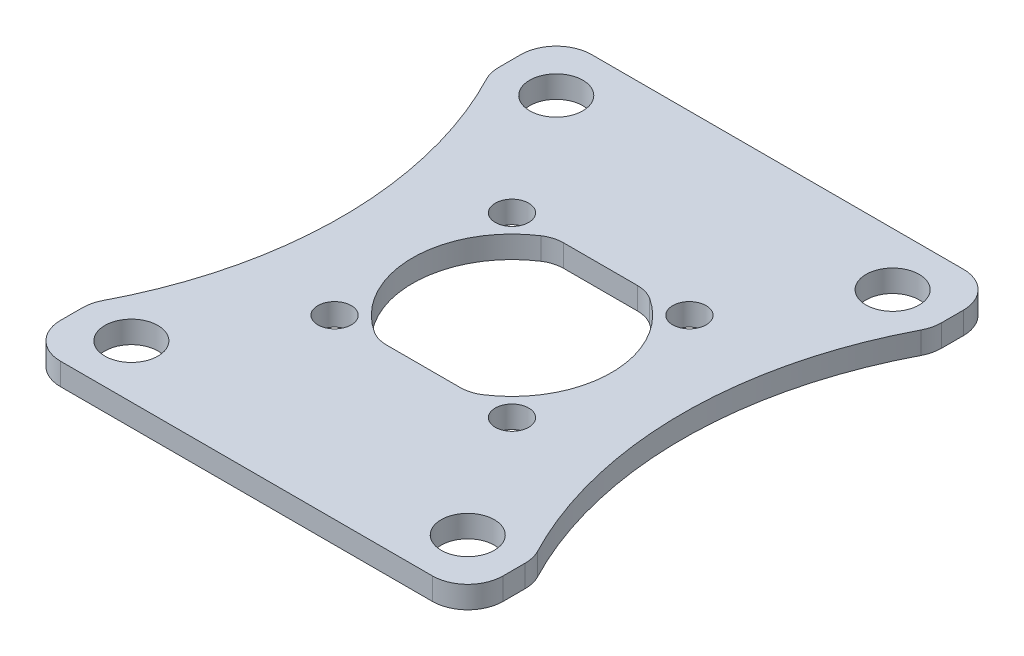
ISO-10303-21;
HEADER;
FILE_DESCRIPTION(('STEP AP214'),'2;1');
FILE_NAME('part.step','',(''),(''),'','','');
FILE_SCHEMA(('AUTOMOTIVE_DESIGN { 1 0 10303 214 1 1 1 1 }'));
ENDSEC;
DATA;
#1=APPLICATION_CONTEXT('core data for automotive mechanical design processes');
#2=APPLICATION_PROTOCOL_DEFINITION('international standard','automotive_design',2000,#1);
#3=PRODUCT_CONTEXT('',#1,'mechanical');
#4=PRODUCT('Part','Part','',(#3));
#5=PRODUCT_RELATED_PRODUCT_CATEGORY('part','',(#4));
#6=PRODUCT_DEFINITION_FORMATION('','',#4);
#7=PRODUCT_DEFINITION_CONTEXT('part definition',#1,'design');
#8=PRODUCT_DEFINITION('design','',#6,#7);
#9=PRODUCT_DEFINITION_SHAPE('','',#8);
#10=(LENGTH_UNIT() NAMED_UNIT(*) SI_UNIT(.MILLI.,.METRE.));
#11=(NAMED_UNIT(*) PLANE_ANGLE_UNIT() SI_UNIT($,.RADIAN.));
#12=(NAMED_UNIT(*) SI_UNIT($,.STERADIAN.) SOLID_ANGLE_UNIT());
#13=UNCERTAINTY_MEASURE_WITH_UNIT(LENGTH_MEASURE(1.E-05),#10,'distance_accuracy_value','');
#14=(GEOMETRIC_REPRESENTATION_CONTEXT(3) GLOBAL_UNCERTAINTY_ASSIGNED_CONTEXT((#13)) GLOBAL_UNIT_ASSIGNED_CONTEXT((#10,
#11,#12)) REPRESENTATION_CONTEXT('',''));
#15=CARTESIAN_POINT('',(0.,0.,0.));
#16=DIRECTION('',(0.,0.,1.));
#17=DIRECTION('',(1.,0.,0.));
#18=AXIS2_PLACEMENT_3D('',#15,#16,#17);
#19=CARTESIAN_POINT('',(15.875,1.5875,19.05));
#20=DIRECTION('',(-1.,0.,0.));
#21=DIRECTION('',(0.,0.,1.));
#22=AXIS2_PLACEMENT_3D('',#19,#20,#21);
#23=PLANE('',#22);
#24=DIRECTION('',(0.,0.,-1.));
#25=VECTOR('',#24,1.);
#26=CARTESIAN_POINT('',(15.875,0.,19.05));
#27=LINE('',#26,#25);
#28=CARTESIAN_POINT('',(15.875,0.,-14.9320894720063));
#29=VERTEX_POINT('',#28);
#30=CARTESIAN_POINT('',(15.875,0.,-16.51));
#31=VERTEX_POINT('',#30);
#32=EDGE_CURVE('E319',#29,#31,#27,.T.);
#33=ORIENTED_EDGE('',*,*,#32,.T.);
#34=DIRECTION('',(0.,-1.,0.));
#35=VECTOR('',#34,1.);
#36=CARTESIAN_POINT('',(15.875,1.5875,-16.51));
#37=LINE('',#36,#35);
#38=CARTESIAN_POINT('',(15.875,1.5875,-16.51));
#39=VERTEX_POINT('',#38);
#40=EDGE_CURVE('E368',#31,#39,#37,.F.);
#41=ORIENTED_EDGE('',*,*,#40,.T.);
#42=DIRECTION('',(0.,0.,-1.));
#43=VECTOR('',#42,1.);
#44=CARTESIAN_POINT('',(15.875,1.5875,19.05));
#45=LINE('',#44,#43);
#46=CARTESIAN_POINT('',(15.875,1.5875,-14.9320894720063));
#47=VERTEX_POINT('',#46);
#48=EDGE_CURVE('E300',#47,#39,#45,.T.);
#49=ORIENTED_EDGE('',*,*,#48,.F.);
#50=DIRECTION('',(0.,-1.,0.));
#51=VECTOR('',#50,1.);
#52=CARTESIAN_POINT('',(15.875,1.5875,-14.9320894720063));
#53=LINE('',#52,#51);
#54=EDGE_CURVE('E365',#47,#29,#53,.T.);
#55=ORIENTED_EDGE('',*,*,#54,.T.);
#56=EDGE_LOOP('',(#33,#41,#49,#55));
#57=FACE_BOUND('',#56,.T.);
#58=ADVANCED_FACE('F35',(#57),#23,.F.);
#59=CARTESIAN_POINT('',(-15.875,1.5875,19.05));
#60=DIRECTION('',(1.,0.,0.));
#61=DIRECTION('',(0.,0.,-1.));
#62=AXIS2_PLACEMENT_3D('',#59,#60,#61);
#63=PLANE('',#62);
#64=DIRECTION('',(0.,0.,1.));
#65=VECTOR('',#64,1.);
#66=CARTESIAN_POINT('',(-15.875,0.,19.05));
#67=LINE('',#66,#65);
#68=CARTESIAN_POINT('',(-15.875,0.,14.9320894720063));
#69=VERTEX_POINT('',#68);
#70=CARTESIAN_POINT('',(-15.875,0.,16.51));
#71=VERTEX_POINT('',#70);
#72=EDGE_CURVE('E322',#69,#71,#67,.T.);
#73=ORIENTED_EDGE('',*,*,#72,.T.);
#74=DIRECTION('',(0.,-1.,0.));
#75=VECTOR('',#74,1.);
#76=CARTESIAN_POINT('',(-15.875,1.5875,16.51));
#77=LINE('',#76,#75);
#78=CARTESIAN_POINT('',(-15.875,1.5875,16.51));
#79=VERTEX_POINT('',#78);
#80=EDGE_CURVE('E388',#71,#79,#77,.F.);
#81=ORIENTED_EDGE('',*,*,#80,.T.);
#82=DIRECTION('',(0.,0.,1.));
#83=VECTOR('',#82,1.);
#84=CARTESIAN_POINT('',(-15.875,1.5875,19.05));
#85=LINE('',#84,#83);
#86=CARTESIAN_POINT('',(-15.875,1.5875,14.9320894720063));
#87=VERTEX_POINT('',#86);
#88=EDGE_CURVE('E308',#87,#79,#85,.T.);
#89=ORIENTED_EDGE('',*,*,#88,.F.);
#90=DIRECTION('',(0.,-1.,0.));
#91=VECTOR('',#90,1.);
#92=CARTESIAN_POINT('',(-15.875,1.5875,14.9320894720063));
#93=LINE('',#92,#91);
#94=EDGE_CURVE('E385',#87,#69,#93,.T.);
#95=ORIENTED_EDGE('',*,*,#94,.T.);
#96=EDGE_LOOP('',(#73,#81,#89,#95));
#97=FACE_BOUND('',#96,.T.);
#98=ADVANCED_FACE('F481',(#97),#63,.F.);
#99=CARTESIAN_POINT('',(0.,1.5875,0.));
#100=DIRECTION('',(0.,-1.,0.));
#101=DIRECTION('',(0.,0.,-1.));
#102=AXIS2_PLACEMENT_3D('',#99,#100,#101);
#103=CYLINDRICAL_SURFACE('',#102,7.1374);
#104=CARTESIAN_POINT('',(0.,1.5875,0.));
#105=DIRECTION('',(0.,1.,0.));
#106=DIRECTION('',(0.,0.,1.));
#107=AXIS2_PLACEMENT_3D('',#104,#105,#106);
#108=CIRCLE('',#107,7.1374);
#109=CARTESIAN_POINT('',(3.89799317546401,1.5875,5.97897382198952));
#110=VERTEX_POINT('',#109);
#111=CARTESIAN_POINT('',(3.89799317546401,1.5875,-5.97897382198953));
#112=VERTEX_POINT('',#111);
#113=EDGE_CURVE('E293',#110,#112,#108,.T.);
#114=ORIENTED_EDGE('',*,*,#113,.T.);
#115=DIRECTION('',(0.,-1.,0.));
#116=VECTOR('',#115,1.);
#117=CARTESIAN_POINT('',(3.89799317546401,1.5875,-5.97897382198953));
#118=LINE('',#117,#116);
#119=CARTESIAN_POINT('',(3.89799317546401,0.,-5.97897382198953));
#120=VERTEX_POINT('',#119);
#121=EDGE_CURVE('E403',#112,#120,#118,.T.);
#122=ORIENTED_EDGE('',*,*,#121,.T.);
#123=CARTESIAN_POINT('',(0.,0.,0.));
#124=DIRECTION('',(0.,1.,0.));
#125=DIRECTION('',(0.,0.,1.));
#126=AXIS2_PLACEMENT_3D('',#123,#124,#125);
#127=CIRCLE('',#126,7.1374);
#128=CARTESIAN_POINT('',(3.89799317546401,0.,5.97897382198952));
#129=VERTEX_POINT('',#128);
#130=EDGE_CURVE('E290',#129,#120,#127,.T.);
#131=ORIENTED_EDGE('',*,*,#130,.F.);
#132=DIRECTION('',(0.,-1.,0.));
#133=VECTOR('',#132,1.);
#134=CARTESIAN_POINT('',(3.89799317546401,1.5875,5.97897382198952));
#135=LINE('',#134,#133);
#136=EDGE_CURVE('E400',#129,#110,#135,.F.);
#137=ORIENTED_EDGE('',*,*,#136,.T.);
#138=EDGE_LOOP('',(#114,#122,#131,#137));
#139=FACE_BOUND('',#138,.T.);
#140=ADVANCED_FACE('F434',(#139),#103,.F.);
#141=CARTESIAN_POINT('',(0.,1.5875,0.));
#142=DIRECTION('',(0.,-1.,0.));
#143=DIRECTION('',(0.,0.,-1.));
#144=AXIS2_PLACEMENT_3D('',#141,#142,#143);
#145=PLANE('',#144);
#146=CARTESIAN_POINT('',(-15.875,1.5875,-16.51));
#147=VERTEX_POINT('',#146);
#148=CARTESIAN_POINT('',(-15.875,1.5875,-14.9320894720063));
#149=VERTEX_POINT('',#148);
#150=EDGE_CURVE('E311',#147,#149,#85,.T.);
#151=ORIENTED_EDGE('',*,*,#150,.T.);
#152=CARTESIAN_POINT('',(-13.335,1.5875,-14.9320894720063));
#153=DIRECTION('',(0.,-1.,0.));
#154=DIRECTION('',(0.,0.,-1.));
#155=AXIS2_PLACEMENT_3D('',#152,#153,#154);
#156=CIRCLE('',#155,2.54);
#157=CARTESIAN_POINT('',(-15.5874528301887,1.5875,-13.7581830669743));
#158=VERTEX_POINT('',#157);
#159=EDGE_CURVE('E358',#149,#158,#156,.F.);
#160=ORIENTED_EDGE('',*,*,#159,.T.);
#161=CARTESIAN_POINT('',(-41.9862,1.5875,0.));
#162=DIRECTION('',(0.,-1.,0.));
#163=DIRECTION('',(0.,0.,1.));
#164=AXIS2_PLACEMENT_3D('',#161,#162,#163);
#165=CIRCLE('',#164,29.7688);
#166=CARTESIAN_POINT('',(-15.5874528301887,1.5875,13.7581830669743));
#167=VERTEX_POINT('',#166);
#168=EDGE_CURVE('E217',#158,#167,#165,.T.);
#169=ORIENTED_EDGE('',*,*,#168,.T.);
#170=CARTESIAN_POINT('',(-13.335,1.5875,14.9320894720063));
#171=DIRECTION('',(0.,-1.,0.));
#172=DIRECTION('',(0.,0.,-1.));
#173=AXIS2_PLACEMENT_3D('',#170,#171,#172);
#174=CIRCLE('',#173,2.54);
#175=EDGE_CURVE('E344',#167,#87,#174,.F.);
#176=ORIENTED_EDGE('',*,*,#175,.T.);
#177=ORIENTED_EDGE('',*,*,#88,.T.);
#178=CARTESIAN_POINT('',(-13.335,1.5875,16.51));
#179=DIRECTION('',(0.,-1.,0.));
#180=DIRECTION('',(0.,0.,-1.));
#181=AXIS2_PLACEMENT_3D('',#178,#179,#180);
#182=CIRCLE('',#181,2.54);
#183=CARTESIAN_POINT('',(-13.335,1.5875,19.05));
#184=VERTEX_POINT('',#183);
#185=EDGE_CURVE('E346',#79,#184,#182,.F.);
#186=ORIENTED_EDGE('',*,*,#185,.T.);
#187=DIRECTION('',(1.,0.,0.));
#188=VECTOR('',#187,1.);
#189=CARTESIAN_POINT('',(-15.875,1.5875,19.05));
#190=LINE('',#189,#188);
#191=CARTESIAN_POINT('',(13.335,1.5875,19.05));
#192=VERTEX_POINT('',#191);
#193=EDGE_CURVE('E312',#184,#192,#190,.T.);
#194=ORIENTED_EDGE('',*,*,#193,.T.);
#195=CARTESIAN_POINT('',(13.335,1.5875,16.51));
#196=DIRECTION('',(0.,-1.,0.));
#197=DIRECTION('',(0.,0.,-1.));
#198=AXIS2_PLACEMENT_3D('',#195,#196,#197);
#199=CIRCLE('',#198,2.54);
#200=CARTESIAN_POINT('',(15.875,1.5875,16.51));
#201=VERTEX_POINT('',#200);
#202=EDGE_CURVE('E348',#192,#201,#199,.F.);
#203=ORIENTED_EDGE('',*,*,#202,.T.);
#204=CARTESIAN_POINT('',(15.875,1.5875,14.9320894720063));
#205=VERTEX_POINT('',#204);
#206=EDGE_CURVE('E303',#201,#205,#45,.T.);
#207=ORIENTED_EDGE('',*,*,#206,.T.);
#208=CARTESIAN_POINT('',(13.335,1.5875,14.9320894720063));
#209=DIRECTION('',(0.,-1.,0.));
#210=DIRECTION('',(0.,0.,-1.));
#211=AXIS2_PLACEMENT_3D('',#208,#209,#210);
#212=CIRCLE('',#211,2.54);
#213=CARTESIAN_POINT('',(15.5874528301887,1.5875,13.7581830669743));
#214=VERTEX_POINT('',#213);
#215=EDGE_CURVE('E350',#205,#214,#212,.F.);
#216=ORIENTED_EDGE('',*,*,#215,.T.);
#217=CARTESIAN_POINT('',(41.9862,1.5875,0.));
#218=DIRECTION('',(0.,-1.,0.));
#219=DIRECTION('',(0.,0.,-1.));
#220=AXIS2_PLACEMENT_3D('',#217,#218,#219);
#221=CIRCLE('',#220,29.7688);
#222=CARTESIAN_POINT('',(15.5874528301887,1.5875,-13.7581830669743));
#223=VERTEX_POINT('',#222);
#224=EDGE_CURVE('E224',#214,#223,#221,.T.);
#225=ORIENTED_EDGE('',*,*,#224,.T.);
#226=CARTESIAN_POINT('',(13.335,1.5875,-14.9320894720063));
#227=DIRECTION('',(0.,-1.,0.));
#228=DIRECTION('',(0.,0.,-1.));
#229=AXIS2_PLACEMENT_3D('',#226,#227,#228);
#230=CIRCLE('',#229,2.54);
#231=EDGE_CURVE('E352',#223,#47,#230,.F.);
#232=ORIENTED_EDGE('',*,*,#231,.T.);
#233=ORIENTED_EDGE('',*,*,#48,.T.);
#234=CARTESIAN_POINT('',(13.335,1.5875,-16.51));
#235=DIRECTION('',(0.,-1.,0.));
#236=DIRECTION('',(0.,0.,-1.));
#237=AXIS2_PLACEMENT_3D('',#234,#235,#236);
#238=CIRCLE('',#237,2.54);
#239=CARTESIAN_POINT('',(13.335,1.5875,-19.05));
#240=VERTEX_POINT('',#239);
#241=EDGE_CURVE('E354',#39,#240,#238,.F.);
#242=ORIENTED_EDGE('',*,*,#241,.T.);
#243=DIRECTION('',(-1.,0.,0.));
#244=VECTOR('',#243,1.);
#245=CARTESIAN_POINT('',(-15.875,1.5875,-19.05));
#246=LINE('',#245,#244);
#247=CARTESIAN_POINT('',(-13.335,1.5875,-19.05));
#248=VERTEX_POINT('',#247);
#249=EDGE_CURVE('E305',#240,#248,#246,.T.);
#250=ORIENTED_EDGE('',*,*,#249,.T.);
#251=CARTESIAN_POINT('',(-13.335,1.5875,-16.51));
#252=DIRECTION('',(0.,-1.,0.));
#253=DIRECTION('',(0.,0.,-1.));
#254=AXIS2_PLACEMENT_3D('',#251,#252,#253);
#255=CIRCLE('',#254,2.54);
#256=EDGE_CURVE('E356',#248,#147,#255,.F.);
#257=ORIENTED_EDGE('',*,*,#256,.T.);
#258=EDGE_LOOP('',(#151,#160,#169,#176,#177,#186,#194,#203,#207,#216,#225,#232,#233,#242,#250,#257));
#259=FACE_BOUND('',#258,.T.);
#260=CARTESIAN_POINT('',(-3.89799317546399,1.5875,-5.97897382198953));
#261=VERTEX_POINT('',#260);
#262=CARTESIAN_POINT('',(-3.89799317546399,1.5875,5.97897382198952));
#263=VERTEX_POINT('',#262);
#264=EDGE_CURVE('E296',#261,#263,#108,.T.);
#265=ORIENTED_EDGE('',*,*,#264,.F.);
#266=CARTESIAN_POINT('',(-2.64952561036876,1.5875,-4.06400000000001));
#267=DIRECTION('',(0.,-1.,0.));
#268=DIRECTION('',(0.,0.,-1.));
#269=AXIS2_PLACEMENT_3D('',#266,#267,#268);
#270=CIRCLE('',#269,2.286);
#271=CARTESIAN_POINT('',(-2.64952561036876,1.5875,-6.35));
#272=VERTEX_POINT('',#271);
#273=EDGE_CURVE('E409',#261,#272,#270,.T.);
#274=ORIENTED_EDGE('',*,*,#273,.T.);
#275=DIRECTION('',(1.,0.,0.));
#276=VECTOR('',#275,1.);
#277=CARTESIAN_POINT('',(-3.25883088852428,1.5875,-6.35));
#278=LINE('',#277,#276);
#279=CARTESIAN_POINT('',(2.64952561036878,1.5875,-6.35));
#280=VERTEX_POINT('',#279);
#281=EDGE_CURVE('E236',#272,#280,#278,.T.);
#282=ORIENTED_EDGE('',*,*,#281,.T.);
#283=CARTESIAN_POINT('',(2.64952561036878,1.5875,-4.06400000000001));
#284=DIRECTION('',(0.,-1.,0.));
#285=DIRECTION('',(0.,0.,-1.));
#286=AXIS2_PLACEMENT_3D('',#283,#284,#285);
#287=CIRCLE('',#286,2.286);
#288=EDGE_CURVE('E413',#280,#112,#287,.T.);
#289=ORIENTED_EDGE('',*,*,#288,.T.);
#290=ORIENTED_EDGE('',*,*,#113,.F.);
#291=CARTESIAN_POINT('',(2.64952561036878,1.5875,4.06399999999999));
#292=DIRECTION('',(0.,-1.,0.));
#293=DIRECTION('',(0.,0.,-1.));
#294=AXIS2_PLACEMENT_3D('',#291,#292,#293);
#295=CIRCLE('',#294,2.286);
#296=CARTESIAN_POINT('',(2.64952561036878,1.5875,6.34999999999999));
#297=VERTEX_POINT('',#296);
#298=EDGE_CURVE('E43',#110,#297,#295,.T.);
#299=ORIENTED_EDGE('',*,*,#298,.T.);
#300=DIRECTION('',(-1.,0.,0.));
#301=VECTOR('',#300,1.);
#302=CARTESIAN_POINT('',(3.25883088852428,1.5875,6.34999999999999));
#303=LINE('',#302,#301);
#304=CARTESIAN_POINT('',(-2.64952561036876,1.5875,6.34999999999999));
#305=VERTEX_POINT('',#304);
#306=EDGE_CURVE('E226',#297,#305,#303,.T.);
#307=ORIENTED_EDGE('',*,*,#306,.T.);
#308=CARTESIAN_POINT('',(-2.64952561036876,1.5875,4.06399999999999));
#309=DIRECTION('',(0.,-1.,0.));
#310=DIRECTION('',(0.,0.,-1.));
#311=AXIS2_PLACEMENT_3D('',#308,#309,#310);
#312=CIRCLE('',#311,2.286);
#313=EDGE_CURVE('E417',#305,#263,#312,.T.);
#314=ORIENTED_EDGE('',*,*,#313,.T.);
#315=EDGE_LOOP('',(#265,#274,#282,#289,#290,#299,#307,#314));
#316=FACE_BOUND('',#315,.T.);
#317=CARTESIAN_POINT('',(-6.36396103067893,1.5875,6.36396103067893));
#318=DIRECTION('',(0.,1.,0.));
#319=DIRECTION('',(0.,0.,1.));
#320=AXIS2_PLACEMENT_3D('',#317,#318,#319);
#321=CIRCLE('',#320,1.2);
#322=CARTESIAN_POINT('',(-6.36396103067893,1.5875,7.56396103067893));
#323=VERTEX_POINT('',#322);
#324=EDGE_CURVE('E287',#323,#323,#321,.T.);
#325=ORIENTED_EDGE('',*,*,#324,.F.);
#326=EDGE_LOOP('',(#325));
#327=FACE_BOUND('',#326,.T.);
#328=CARTESIAN_POINT('',(-6.36396103067893,1.5875,-6.36396103067893));
#329=DIRECTION('',(0.,1.,0.));
#330=DIRECTION('',(0.,0.,1.));
#331=AXIS2_PLACEMENT_3D('',#328,#329,#330);
#332=CIRCLE('',#331,1.2);
#333=CARTESIAN_POINT('',(-6.36396103067893,1.5875,-5.16396103067893));
#334=VERTEX_POINT('',#333);
#335=EDGE_CURVE('E281',#334,#334,#332,.T.);
#336=ORIENTED_EDGE('',*,*,#335,.F.);
#337=EDGE_LOOP('',(#336));
#338=FACE_BOUND('',#337,.T.);
#339=CARTESIAN_POINT('',(6.36396103067893,1.5875,-6.36396103067893));
#340=DIRECTION('',(0.,1.,0.));
#341=DIRECTION('',(0.,0.,1.));
#342=AXIS2_PLACEMENT_3D('',#339,#340,#341);
#343=CIRCLE('',#342,1.2);
#344=CARTESIAN_POINT('',(6.36396103067893,1.5875,-5.16396103067893));
#345=VERTEX_POINT('',#344);
#346=EDGE_CURVE('E275',#345,#345,#343,.T.);
#347=ORIENTED_EDGE('',*,*,#346,.F.);
#348=EDGE_LOOP('',(#347));
#349=FACE_BOUND('',#348,.T.);
#350=CARTESIAN_POINT('',(6.36396103067893,1.5875,6.36396103067893));
#351=DIRECTION('',(0.,1.,0.));
#352=DIRECTION('',(0.,0.,1.));
#353=AXIS2_PLACEMENT_3D('',#350,#351,#352);
#354=CIRCLE('',#353,1.2);
#355=CARTESIAN_POINT('',(6.36396103067893,1.5875,7.56396103067893));
#356=VERTEX_POINT('',#355);
#357=EDGE_CURVE('E269',#356,#356,#354,.T.);
#358=ORIENTED_EDGE('',*,*,#357,.F.);
#359=EDGE_LOOP('',(#358));
#360=FACE_BOUND('',#359,.T.);
#361=CARTESIAN_POINT('',(-12.065,1.5875,15.24));
#362=DIRECTION('',(0.,1.,0.));
#363=DIRECTION('',(0.,0.,1.));
#364=AXIS2_PLACEMENT_3D('',#361,#362,#363);
#365=CIRCLE('',#364,1.905);
#366=CARTESIAN_POINT('',(-12.065,1.5875,17.145));
#367=VERTEX_POINT('',#366);
#368=EDGE_CURVE('E263',#367,#367,#365,.T.);
#369=ORIENTED_EDGE('',*,*,#368,.F.);
#370=EDGE_LOOP('',(#369));
#371=FACE_BOUND('',#370,.T.);
#372=CARTESIAN_POINT('',(-12.065,1.5875,-15.24));
#373=DIRECTION('',(0.,1.,0.));
#374=DIRECTION('',(0.,0.,1.));
#375=AXIS2_PLACEMENT_3D('',#372,#373,#374);
#376=CIRCLE('',#375,1.905);
#377=CARTESIAN_POINT('',(-12.065,1.5875,-13.335));
#378=VERTEX_POINT('',#377);
#379=EDGE_CURVE('E257',#378,#378,#376,.T.);
#380=ORIENTED_EDGE('',*,*,#379,.F.);
#381=EDGE_LOOP('',(#380));
#382=FACE_BOUND('',#381,.T.);
#383=CARTESIAN_POINT('',(12.065,1.5875,-15.24));
#384=DIRECTION('',(0.,1.,0.));
#385=DIRECTION('',(0.,0.,1.));
#386=AXIS2_PLACEMENT_3D('',#383,#384,#385);
#387=CIRCLE('',#386,1.905);
#388=CARTESIAN_POINT('',(12.065,1.5875,-13.335));
#389=VERTEX_POINT('',#388);
#390=EDGE_CURVE('E251',#389,#389,#387,.T.);
#391=ORIENTED_EDGE('',*,*,#390,.F.);
#392=EDGE_LOOP('',(#391));
#393=FACE_BOUND('',#392,.T.);
#394=CARTESIAN_POINT('',(12.065,1.5875,15.24));
#395=DIRECTION('',(0.,1.,0.));
#396=DIRECTION('',(0.,0.,1.));
#397=AXIS2_PLACEMENT_3D('',#394,#395,#396);
#398=CIRCLE('',#397,1.905);
#399=CARTESIAN_POINT('',(12.065,1.5875,17.145));
#400=VERTEX_POINT('',#399);
#401=EDGE_CURVE('E245',#400,#400,#398,.T.);
#402=ORIENTED_EDGE('',*,*,#401,.F.);
#403=EDGE_LOOP('',(#402));
#404=FACE_BOUND('',#403,.T.);
#405=ADVANCED_FACE('F422',(#259,#316,#327,#338,#349,#360,#371,#382,#393,#404),#145,.F.);
#406=CARTESIAN_POINT('',(0.,0.,0.));
#407=DIRECTION('',(0.,-1.,0.));
#408=DIRECTION('',(0.,0.,-1.));
#409=AXIS2_PLACEMENT_3D('',#406,#407,#408);
#410=PLANE('',#409);
#411=CARTESIAN_POINT('',(-41.9862,0.,0.));
#412=DIRECTION('',(0.,-1.,0.));
#413=DIRECTION('',(0.,0.,1.));
#414=AXIS2_PLACEMENT_3D('',#411,#412,#413);
#415=CIRCLE('',#414,29.7688);
#416=CARTESIAN_POINT('',(-15.5874528301887,0.,-13.7581830669743));
#417=VERTEX_POINT('',#416);
#418=CARTESIAN_POINT('',(-15.5874528301887,0.,13.7581830669743));
#419=VERTEX_POINT('',#418);
#420=EDGE_CURVE('E214',#417,#419,#415,.T.);
#421=ORIENTED_EDGE('',*,*,#420,.F.);
#422=CARTESIAN_POINT('',(-13.335,0.,-14.9320894720063));
#423=DIRECTION('',(0.,-1.,0.));
#424=DIRECTION('',(0.,0.,-1.));
#425=AXIS2_PLACEMENT_3D('',#422,#423,#424);
#426=CIRCLE('',#425,2.54);
#427=CARTESIAN_POINT('',(-15.875,0.,-14.9320894720063));
#428=VERTEX_POINT('',#427);
#429=EDGE_CURVE('E197',#417,#428,#426,.T.);
#430=ORIENTED_EDGE('',*,*,#429,.T.);
#431=CARTESIAN_POINT('',(-15.875,0.,-16.51));
#432=VERTEX_POINT('',#431);
#433=EDGE_CURVE('E325',#432,#428,#67,.T.);
#434=ORIENTED_EDGE('',*,*,#433,.F.);
#435=CARTESIAN_POINT('',(-13.335,0.,-16.51));
#436=DIRECTION('',(0.,-1.,0.));
#437=DIRECTION('',(0.,0.,-1.));
#438=AXIS2_PLACEMENT_3D('',#435,#436,#437);
#439=CIRCLE('',#438,2.54);
#440=CARTESIAN_POINT('',(-13.335,0.,-19.05));
#441=VERTEX_POINT('',#440);
#442=EDGE_CURVE('E208',#432,#441,#439,.T.);
#443=ORIENTED_EDGE('',*,*,#442,.T.);
#444=DIRECTION('',(-1.,0.,0.));
#445=VECTOR('',#444,1.);
#446=CARTESIAN_POINT('',(-15.875,0.,-19.05));
#447=LINE('',#446,#445);
#448=CARTESIAN_POINT('',(13.335,0.,-19.05));
#449=VERTEX_POINT('',#448);
#450=EDGE_CURVE('E318',#449,#441,#447,.T.);
#451=ORIENTED_EDGE('',*,*,#450,.F.);
#452=CARTESIAN_POINT('',(13.335,0.,-16.51));
#453=DIRECTION('',(0.,-1.,0.));
#454=DIRECTION('',(0.,0.,-1.));
#455=AXIS2_PLACEMENT_3D('',#452,#453,#454);
#456=CIRCLE('',#455,2.54);
#457=EDGE_CURVE('E338',#449,#31,#456,.T.);
#458=ORIENTED_EDGE('',*,*,#457,.T.);
#459=ORIENTED_EDGE('',*,*,#32,.F.);
#460=CARTESIAN_POINT('',(13.335,0.,-14.9320894720063));
#461=DIRECTION('',(0.,-1.,0.));
#462=DIRECTION('',(0.,0.,-1.));
#463=AXIS2_PLACEMENT_3D('',#460,#461,#462);
#464=CIRCLE('',#463,2.54);
#465=CARTESIAN_POINT('',(15.5874528301887,0.,-13.7581830669743));
#466=VERTEX_POINT('',#465);
#467=EDGE_CURVE('E336',#29,#466,#464,.T.);
#468=ORIENTED_EDGE('',*,*,#467,.T.);
#469=CARTESIAN_POINT('',(41.9862,0.,0.));
#470=DIRECTION('',(0.,-1.,0.));
#471=DIRECTION('',(0.,0.,-1.));
#472=AXIS2_PLACEMENT_3D('',#469,#470,#471);
#473=CIRCLE('',#472,29.7688);
#474=CARTESIAN_POINT('',(15.5874528301887,0.,13.7581830669743));
#475=VERTEX_POINT('',#474);
#476=EDGE_CURVE('E229',#475,#466,#473,.T.);
#477=ORIENTED_EDGE('',*,*,#476,.F.);
#478=CARTESIAN_POINT('',(13.335,0.,14.9320894720063));
#479=DIRECTION('',(0.,-1.,0.));
#480=DIRECTION('',(0.,0.,-1.));
#481=AXIS2_PLACEMENT_3D('',#478,#479,#480);
#482=CIRCLE('',#481,2.54);
#483=CARTESIAN_POINT('',(15.875,0.,14.9320894720063));
#484=VERTEX_POINT('',#483);
#485=EDGE_CURVE('E334',#475,#484,#482,.T.);
#486=ORIENTED_EDGE('',*,*,#485,.T.);
#487=CARTESIAN_POINT('',(15.875,0.,16.51));
#488=VERTEX_POINT('',#487);
#489=EDGE_CURVE('E315',#488,#484,#27,.T.);
#490=ORIENTED_EDGE('',*,*,#489,.F.);
#491=CARTESIAN_POINT('',(13.335,0.,16.51));
#492=DIRECTION('',(0.,-1.,0.));
#493=DIRECTION('',(0.,0.,-1.));
#494=AXIS2_PLACEMENT_3D('',#491,#492,#493);
#495=CIRCLE('',#494,2.54);
#496=CARTESIAN_POINT('',(13.335,0.,19.05));
#497=VERTEX_POINT('',#496);
#498=EDGE_CURVE('E332',#488,#497,#495,.T.);
#499=ORIENTED_EDGE('',*,*,#498,.T.);
#500=DIRECTION('',(1.,0.,0.));
#501=VECTOR('',#500,1.);
#502=CARTESIAN_POINT('',(-15.875,0.,19.05));
#503=LINE('',#502,#501);
#504=CARTESIAN_POINT('',(-13.335,0.,19.05));
#505=VERTEX_POINT('',#504);
#506=EDGE_CURVE('E304',#505,#497,#503,.T.);
#507=ORIENTED_EDGE('',*,*,#506,.F.);
#508=CARTESIAN_POINT('',(-13.335,0.,16.51));
#509=DIRECTION('',(0.,-1.,0.));
#510=DIRECTION('',(0.,0.,-1.));
#511=AXIS2_PLACEMENT_3D('',#508,#509,#510);
#512=CIRCLE('',#511,2.54);
#513=EDGE_CURVE('E330',#505,#71,#512,.T.);
#514=ORIENTED_EDGE('',*,*,#513,.T.);
#515=ORIENTED_EDGE('',*,*,#72,.F.);
#516=CARTESIAN_POINT('',(-13.335,0.,14.9320894720063));
#517=DIRECTION('',(0.,-1.,0.));
#518=DIRECTION('',(0.,0.,-1.));
#519=AXIS2_PLACEMENT_3D('',#516,#517,#518);
#520=CIRCLE('',#519,2.54);
#521=EDGE_CURVE('E218',#69,#419,#520,.T.);
#522=ORIENTED_EDGE('',*,*,#521,.T.);
#523=EDGE_LOOP('',(#421,#430,#434,#443,#451,#458,#459,#468,#477,#486,#490,#499,#507,#514,#515,#522));
#524=FACE_BOUND('',#523,.T.);
#525=CARTESIAN_POINT('',(12.065,0.,-15.24));
#526=DIRECTION('',(0.,1.,0.));
#527=DIRECTION('',(0.,0.,1.));
#528=AXIS2_PLACEMENT_3D('',#525,#526,#527);
#529=CIRCLE('',#528,1.905);
#530=CARTESIAN_POINT('',(12.065,0.,-13.335));
#531=VERTEX_POINT('',#530);
#532=EDGE_CURVE('E248',#531,#531,#529,.T.);
#533=ORIENTED_EDGE('',*,*,#532,.T.);
#534=EDGE_LOOP('',(#533));
#535=FACE_BOUND('',#534,.T.);
#536=CARTESIAN_POINT('',(-12.065,0.,15.24));
#537=DIRECTION('',(0.,1.,0.));
#538=DIRECTION('',(0.,0.,1.));
#539=AXIS2_PLACEMENT_3D('',#536,#537,#538);
#540=CIRCLE('',#539,1.905);
#541=CARTESIAN_POINT('',(-12.065,0.,17.145));
#542=VERTEX_POINT('',#541);
#543=EDGE_CURVE('E260',#542,#542,#540,.T.);
#544=ORIENTED_EDGE('',*,*,#543,.T.);
#545=EDGE_LOOP('',(#544));
#546=FACE_BOUND('',#545,.T.);
#547=CARTESIAN_POINT('',(6.36396103067893,0.,-6.36396103067893));
#548=DIRECTION('',(0.,1.,0.));
#549=DIRECTION('',(0.,0.,1.));
#550=AXIS2_PLACEMENT_3D('',#547,#548,#549);
#551=CIRCLE('',#550,1.2);
#552=CARTESIAN_POINT('',(6.36396103067893,0.,-5.16396103067893));
#553=VERTEX_POINT('',#552);
#554=EDGE_CURVE('E272',#553,#553,#551,.T.);
#555=ORIENTED_EDGE('',*,*,#554,.T.);
#556=EDGE_LOOP('',(#555));
#557=FACE_BOUND('',#556,.T.);
#558=CARTESIAN_POINT('',(-6.36396103067893,0.,6.36396103067893));
#559=DIRECTION('',(0.,1.,0.));
#560=DIRECTION('',(0.,0.,1.));
#561=AXIS2_PLACEMENT_3D('',#558,#559,#560);
#562=CIRCLE('',#561,1.2);
#563=CARTESIAN_POINT('',(-6.36396103067893,0.,7.56396103067893));
#564=VERTEX_POINT('',#563);
#565=EDGE_CURVE('E284',#564,#564,#562,.T.);
#566=ORIENTED_EDGE('',*,*,#565,.T.);
#567=EDGE_LOOP('',(#566));
#568=FACE_BOUND('',#567,.T.);
#569=DIRECTION('',(1.,0.,0.));
#570=VECTOR('',#569,1.);
#571=CARTESIAN_POINT('',(-3.25883088852428,0.,-6.35));
#572=LINE('',#571,#570);
#573=CARTESIAN_POINT('',(-2.64952561036876,0.,-6.35));
#574=VERTEX_POINT('',#573);
#575=CARTESIAN_POINT('',(2.64952561036878,0.,-6.35));
#576=VERTEX_POINT('',#575);
#577=EDGE_CURVE('E239',#574,#576,#572,.T.);
#578=ORIENTED_EDGE('',*,*,#577,.F.);
#579=CARTESIAN_POINT('',(-2.64952561036876,0.,-4.06400000000001));
#580=DIRECTION('',(0.,-1.,0.));
#581=DIRECTION('',(0.,0.,-1.));
#582=AXIS2_PLACEMENT_3D('',#579,#580,#581);
#583=CIRCLE('',#582,2.286);
#584=CARTESIAN_POINT('',(-3.89799317546399,0.,-5.97897382198953));
#585=VERTEX_POINT('',#584);
#586=EDGE_CURVE('E411',#574,#585,#583,.F.);
#587=ORIENTED_EDGE('',*,*,#586,.T.);
#588=CARTESIAN_POINT('',(-3.89799317546399,0.,5.97897382198952));
#589=VERTEX_POINT('',#588);
#590=EDGE_CURVE('E297',#585,#589,#127,.T.);
#591=ORIENTED_EDGE('',*,*,#590,.T.);
#592=CARTESIAN_POINT('',(-2.64952561036876,0.,4.06399999999999));
#593=DIRECTION('',(0.,-1.,0.));
#594=DIRECTION('',(0.,0.,-1.));
#595=AXIS2_PLACEMENT_3D('',#592,#593,#594);
#596=CIRCLE('',#595,2.286);
#597=CARTESIAN_POINT('',(-2.64952561036876,0.,6.34999999999999));
#598=VERTEX_POINT('',#597);
#599=EDGE_CURVE('E50',#589,#598,#596,.F.);
#600=ORIENTED_EDGE('',*,*,#599,.T.);
#601=DIRECTION('',(-1.,0.,0.));
#602=VECTOR('',#601,1.);
#603=CARTESIAN_POINT('',(3.25883088852428,0.,6.34999999999999));
#604=LINE('',#603,#602);
#605=CARTESIAN_POINT('',(2.64952561036878,0.,6.34999999999999));
#606=VERTEX_POINT('',#605);
#607=EDGE_CURVE('E234',#606,#598,#604,.T.);
#608=ORIENTED_EDGE('',*,*,#607,.F.);
#609=CARTESIAN_POINT('',(2.64952561036878,0.,4.06399999999999));
#610=DIRECTION('',(0.,-1.,0.));
#611=DIRECTION('',(0.,0.,-1.));
#612=AXIS2_PLACEMENT_3D('',#609,#610,#611);
#613=CIRCLE('',#612,2.286);
#614=EDGE_CURVE('E11',#606,#129,#613,.F.);
#615=ORIENTED_EDGE('',*,*,#614,.T.);
#616=ORIENTED_EDGE('',*,*,#130,.T.);
#617=CARTESIAN_POINT('',(2.64952561036878,0.,-4.06400000000001));
#618=DIRECTION('',(0.,-1.,0.));
#619=DIRECTION('',(0.,0.,-1.));
#620=AXIS2_PLACEMENT_3D('',#617,#618,#619);
#621=CIRCLE('',#620,2.286);
#622=EDGE_CURVE('E415',#120,#576,#621,.F.);
#623=ORIENTED_EDGE('',*,*,#622,.T.);
#624=EDGE_LOOP('',(#578,#587,#591,#600,#608,#615,#616,#623));
#625=FACE_BOUND('',#624,.T.);
#626=CARTESIAN_POINT('',(-6.36396103067893,0.,-6.36396103067893));
#627=DIRECTION('',(0.,1.,0.));
#628=DIRECTION('',(0.,0.,1.));
#629=AXIS2_PLACEMENT_3D('',#626,#627,#628);
#630=CIRCLE('',#629,1.2);
#631=CARTESIAN_POINT('',(-6.36396103067893,0.,-5.16396103067893));
#632=VERTEX_POINT('',#631);
#633=EDGE_CURVE('E278',#632,#632,#630,.T.);
#634=ORIENTED_EDGE('',*,*,#633,.T.);
#635=EDGE_LOOP('',(#634));
#636=FACE_BOUND('',#635,.T.);
#637=CARTESIAN_POINT('',(6.36396103067893,0.,6.36396103067893));
#638=DIRECTION('',(0.,1.,0.));
#639=DIRECTION('',(0.,0.,1.));
#640=AXIS2_PLACEMENT_3D('',#637,#638,#639);
#641=CIRCLE('',#640,1.2);
#642=CARTESIAN_POINT('',(6.36396103067893,0.,7.56396103067893));
#643=VERTEX_POINT('',#642);
#644=EDGE_CURVE('E266',#643,#643,#641,.T.);
#645=ORIENTED_EDGE('',*,*,#644,.T.);
#646=EDGE_LOOP('',(#645));
#647=FACE_BOUND('',#646,.T.);
#648=CARTESIAN_POINT('',(-12.065,0.,-15.24));
#649=DIRECTION('',(0.,1.,0.));
#650=DIRECTION('',(0.,0.,1.));
#651=AXIS2_PLACEMENT_3D('',#648,#649,#650);
#652=CIRCLE('',#651,1.905);
#653=CARTESIAN_POINT('',(-12.065,0.,-13.335));
#654=VERTEX_POINT('',#653);
#655=EDGE_CURVE('E254',#654,#654,#652,.T.);
#656=ORIENTED_EDGE('',*,*,#655,.T.);
#657=EDGE_LOOP('',(#656));
#658=FACE_BOUND('',#657,.T.);
#659=CARTESIAN_POINT('',(12.065,0.,15.24));
#660=DIRECTION('',(0.,1.,0.));
#661=DIRECTION('',(0.,0.,1.));
#662=AXIS2_PLACEMENT_3D('',#659,#660,#661);
#663=CIRCLE('',#662,1.905);
#664=CARTESIAN_POINT('',(12.065,0.,17.145));
#665=VERTEX_POINT('',#664);
#666=EDGE_CURVE('E242',#665,#665,#663,.T.);
#667=ORIENTED_EDGE('',*,*,#666,.T.);
#668=EDGE_LOOP('',(#667));
#669=FACE_BOUND('',#668,.T.);
#670=ADVANCED_FACE('F221',(#524,#535,#546,#557,#568,#625,#636,#647,#658,#669),#410,.T.);
#671=ORIENTED_EDGE('',*,*,#489,.T.);
#672=DIRECTION('',(0.,-1.,0.));
#673=VECTOR('',#672,1.);
#674=CARTESIAN_POINT('',(15.875,1.5875,14.9320894720063));
#675=LINE('',#674,#673);
#676=EDGE_CURVE('E378',#484,#205,#675,.F.);
#677=ORIENTED_EDGE('',*,*,#676,.T.);
#678=ORIENTED_EDGE('',*,*,#206,.F.);
#679=DIRECTION('',(0.,-1.,0.));
#680=VECTOR('',#679,1.);
#681=CARTESIAN_POINT('',(15.875,1.5875,16.51));
#682=LINE('',#681,#680);
#683=EDGE_CURVE('E375',#201,#488,#682,.T.);
#684=ORIENTED_EDGE('',*,*,#683,.T.);
#685=EDGE_LOOP('',(#671,#677,#678,#684));
#686=FACE_BOUND('',#685,.T.);
#687=ADVANCED_FACE('F488',(#686),#23,.F.);
#688=CARTESIAN_POINT('',(-15.875,1.5875,-19.05));
#689=DIRECTION('',(0.,0.,1.));
#690=DIRECTION('',(1.,0.,0.));
#691=AXIS2_PLACEMENT_3D('',#688,#689,#690);
#692=PLANE('',#691);
#693=ORIENTED_EDGE('',*,*,#450,.T.);
#694=DIRECTION('',(0.,-1.,0.));
#695=VECTOR('',#694,1.);
#696=CARTESIAN_POINT('',(-13.335,1.5875,-19.05));
#697=LINE('',#696,#695);
#698=EDGE_CURVE('E363',#441,#248,#697,.F.);
#699=ORIENTED_EDGE('',*,*,#698,.T.);
#700=ORIENTED_EDGE('',*,*,#249,.F.);
#701=DIRECTION('',(0.,-1.,0.));
#702=VECTOR('',#701,1.);
#703=CARTESIAN_POINT('',(13.335,1.5875,-19.05));
#704=LINE('',#703,#702);
#705=EDGE_CURVE('E360',#240,#449,#704,.T.);
#706=ORIENTED_EDGE('',*,*,#705,.T.);
#707=EDGE_LOOP('',(#693,#699,#700,#706));
#708=FACE_BOUND('',#707,.T.);
#709=ADVANCED_FACE('F469',(#708),#692,.F.);
#710=ORIENTED_EDGE('',*,*,#433,.T.);
#711=DIRECTION('',(0.,-1.,0.));
#712=VECTOR('',#711,1.);
#713=CARTESIAN_POINT('',(-15.875,1.5875,-14.9320894720063));
#714=LINE('',#713,#712);
#715=EDGE_CURVE('E202',#428,#149,#714,.F.);
#716=ORIENTED_EDGE('',*,*,#715,.T.);
#717=ORIENTED_EDGE('',*,*,#150,.F.);
#718=DIRECTION('',(0.,-1.,0.));
#719=VECTOR('',#718,1.);
#720=CARTESIAN_POINT('',(-15.875,1.5875,-16.51));
#721=LINE('',#720,#719);
#722=EDGE_CURVE('E207',#147,#432,#721,.T.);
#723=ORIENTED_EDGE('',*,*,#722,.T.);
#724=EDGE_LOOP('',(#710,#716,#717,#723));
#725=FACE_BOUND('',#724,.T.);
#726=ADVANCED_FACE('F477',(#725),#63,.F.);
#727=CARTESIAN_POINT('',(-15.875,1.5875,19.05));
#728=DIRECTION('',(0.,0.,-1.));
#729=DIRECTION('',(-1.,0.,0.));
#730=AXIS2_PLACEMENT_3D('',#727,#728,#729);
#731=PLANE('',#730);
#732=ORIENTED_EDGE('',*,*,#506,.T.);
#733=DIRECTION('',(0.,-1.,0.));
#734=VECTOR('',#733,1.);
#735=CARTESIAN_POINT('',(13.335,1.5875,19.05));
#736=LINE('',#735,#734);
#737=EDGE_CURVE('E383',#497,#192,#736,.F.);
#738=ORIENTED_EDGE('',*,*,#737,.T.);
#739=ORIENTED_EDGE('',*,*,#193,.F.);
#740=DIRECTION('',(0.,-1.,0.));
#741=VECTOR('',#740,1.);
#742=CARTESIAN_POINT('',(-13.335,1.5875,19.05));
#743=LINE('',#742,#741);
#744=EDGE_CURVE('E380',#184,#505,#743,.T.);
#745=ORIENTED_EDGE('',*,*,#744,.T.);
#746=EDGE_LOOP('',(#732,#738,#739,#745));
#747=FACE_BOUND('',#746,.T.);
#748=ADVANCED_FACE('F479',(#747),#731,.F.);
#749=ORIENTED_EDGE('',*,*,#590,.F.);
#750=DIRECTION('',(0.,-1.,0.));
#751=VECTOR('',#750,1.);
#752=CARTESIAN_POINT('',(-3.89799317546399,1.5875,-5.97897382198953));
#753=LINE('',#752,#751);
#754=EDGE_CURVE('E392',#585,#261,#753,.F.);
#755=ORIENTED_EDGE('',*,*,#754,.T.);
#756=ORIENTED_EDGE('',*,*,#264,.T.);
#757=DIRECTION('',(0.,-1.,0.));
#758=VECTOR('',#757,1.);
#759=CARTESIAN_POINT('',(-3.89799317546399,1.5875,5.97897382198952));
#760=LINE('',#759,#758);
#761=EDGE_CURVE('E390',#263,#589,#760,.T.);
#762=ORIENTED_EDGE('',*,*,#761,.T.);
#763=EDGE_LOOP('',(#749,#755,#756,#762));
#764=FACE_BOUND('',#763,.T.);
#765=ADVANCED_FACE('F449',(#764),#103,.F.);
#766=CARTESIAN_POINT('',(-6.36396103067893,1.5875,6.36396103067893));
#767=DIRECTION('',(0.,-1.,0.));
#768=DIRECTION('',(0.,0.,-1.));
#769=AXIS2_PLACEMENT_3D('',#766,#767,#768);
#770=CYLINDRICAL_SURFACE('',#769,1.2);
#771=ORIENTED_EDGE('',*,*,#324,.T.);
#772=EDGE_LOOP('',(#771));
#773=FACE_BOUND('',#772,.T.);
#774=ORIENTED_EDGE('',*,*,#565,.F.);
#775=EDGE_LOOP('',(#774));
#776=FACE_BOUND('',#775,.T.);
#777=ADVANCED_FACE('F598',(#773,#776),#770,.F.);
#778=CARTESIAN_POINT('',(-6.36396103067893,1.5875,-6.36396103067893));
#779=DIRECTION('',(0.,-1.,0.));
#780=DIRECTION('',(0.,0.,-1.));
#781=AXIS2_PLACEMENT_3D('',#778,#779,#780);
#782=CYLINDRICAL_SURFACE('',#781,1.2);
#783=ORIENTED_EDGE('',*,*,#335,.T.);
#784=EDGE_LOOP('',(#783));
#785=FACE_BOUND('',#784,.T.);
#786=ORIENTED_EDGE('',*,*,#633,.F.);
#787=EDGE_LOOP('',(#786));
#788=FACE_BOUND('',#787,.T.);
#789=ADVANCED_FACE('F772',(#785,#788),#782,.F.);
#790=CARTESIAN_POINT('',(6.36396103067893,1.5875,-6.36396103067893));
#791=DIRECTION('',(0.,-1.,0.));
#792=DIRECTION('',(0.,0.,-1.));
#793=AXIS2_PLACEMENT_3D('',#790,#791,#792);
#794=CYLINDRICAL_SURFACE('',#793,1.2);
#795=ORIENTED_EDGE('',*,*,#346,.T.);
#796=EDGE_LOOP('',(#795));
#797=FACE_BOUND('',#796,.T.);
#798=ORIENTED_EDGE('',*,*,#554,.F.);
#799=EDGE_LOOP('',(#798));
#800=FACE_BOUND('',#799,.T.);
#801=ADVANCED_FACE('F762',(#797,#800),#794,.F.);
#802=CARTESIAN_POINT('',(6.36396103067893,1.5875,6.36396103067893));
#803=DIRECTION('',(0.,-1.,0.));
#804=DIRECTION('',(0.,0.,-1.));
#805=AXIS2_PLACEMENT_3D('',#802,#803,#804);
#806=CYLINDRICAL_SURFACE('',#805,1.2);
#807=ORIENTED_EDGE('',*,*,#357,.T.);
#808=EDGE_LOOP('',(#807));
#809=FACE_BOUND('',#808,.T.);
#810=ORIENTED_EDGE('',*,*,#644,.F.);
#811=EDGE_LOOP('',(#810));
#812=FACE_BOUND('',#811,.T.);
#813=ADVANCED_FACE('F752',(#809,#812),#806,.F.);
#814=CARTESIAN_POINT('',(-12.065,1.5875,15.24));
#815=DIRECTION('',(0.,-1.,0.));
#816=DIRECTION('',(0.,0.,-1.));
#817=AXIS2_PLACEMENT_3D('',#814,#815,#816);
#818=CYLINDRICAL_SURFACE('',#817,1.905);
#819=ORIENTED_EDGE('',*,*,#368,.T.);
#820=EDGE_LOOP('',(#819));
#821=FACE_BOUND('',#820,.T.);
#822=ORIENTED_EDGE('',*,*,#543,.F.);
#823=EDGE_LOOP('',(#822));
#824=FACE_BOUND('',#823,.T.);
#825=ADVANCED_FACE('F742',(#821,#824),#818,.F.);
#826=CARTESIAN_POINT('',(-12.065,1.5875,-15.24));
#827=DIRECTION('',(0.,-1.,0.));
#828=DIRECTION('',(0.,0.,-1.));
#829=AXIS2_PLACEMENT_3D('',#826,#827,#828);
#830=CYLINDRICAL_SURFACE('',#829,1.905);
#831=ORIENTED_EDGE('',*,*,#379,.T.);
#832=EDGE_LOOP('',(#831));
#833=FACE_BOUND('',#832,.T.);
#834=ORIENTED_EDGE('',*,*,#655,.F.);
#835=EDGE_LOOP('',(#834));
#836=FACE_BOUND('',#835,.T.);
#837=ADVANCED_FACE('F732',(#833,#836),#830,.F.);
#838=CARTESIAN_POINT('',(12.065,1.5875,-15.24));
#839=DIRECTION('',(0.,-1.,0.));
#840=DIRECTION('',(0.,0.,-1.));
#841=AXIS2_PLACEMENT_3D('',#838,#839,#840);
#842=CYLINDRICAL_SURFACE('',#841,1.905);
#843=ORIENTED_EDGE('',*,*,#390,.T.);
#844=EDGE_LOOP('',(#843));
#845=FACE_BOUND('',#844,.T.);
#846=ORIENTED_EDGE('',*,*,#532,.F.);
#847=EDGE_LOOP('',(#846));
#848=FACE_BOUND('',#847,.T.);
#849=ADVANCED_FACE('F722',(#845,#848),#842,.F.);
#850=CARTESIAN_POINT('',(12.065,1.5875,15.24));
#851=DIRECTION('',(0.,-1.,0.));
#852=DIRECTION('',(0.,0.,-1.));
#853=AXIS2_PLACEMENT_3D('',#850,#851,#852);
#854=CYLINDRICAL_SURFACE('',#853,1.905);
#855=ORIENTED_EDGE('',*,*,#401,.T.);
#856=EDGE_LOOP('',(#855));
#857=FACE_BOUND('',#856,.T.);
#858=ORIENTED_EDGE('',*,*,#666,.F.);
#859=EDGE_LOOP('',(#858));
#860=FACE_BOUND('',#859,.T.);
#861=ADVANCED_FACE('F587',(#857,#860),#854,.F.);
#862=CARTESIAN_POINT('',(-3.25883088852428,0.,-6.35));
#863=DIRECTION('',(0.,0.,1.));
#864=DIRECTION('',(1.,0.,0.));
#865=AXIS2_PLACEMENT_3D('',#862,#863,#864);
#866=PLANE('',#865);
#867=ORIENTED_EDGE('',*,*,#281,.F.);
#868=DIRECTION('',(0.,1.,0.));
#869=VECTOR('',#868,1.);
#870=CARTESIAN_POINT('',(-2.64952561036876,0.,-6.35));
#871=LINE('',#870,#869);
#872=EDGE_CURVE('E398',#272,#574,#871,.F.);
#873=ORIENTED_EDGE('',*,*,#872,.T.);
#874=ORIENTED_EDGE('',*,*,#577,.T.);
#875=DIRECTION('',(0.,1.,0.));
#876=VECTOR('',#875,1.);
#877=CARTESIAN_POINT('',(2.64952561036878,1.5875,-6.35));
#878=LINE('',#877,#876);
#879=EDGE_CURVE('E395',#576,#280,#878,.T.);
#880=ORIENTED_EDGE('',*,*,#879,.T.);
#881=EDGE_LOOP('',(#867,#873,#874,#880));
#882=FACE_BOUND('',#881,.T.);
#883=ADVANCED_FACE('F442',(#882),#866,.T.);
#884=CARTESIAN_POINT('',(3.25883088852428,0.,6.34999999999999));
#885=DIRECTION('',(0.,0.,-1.));
#886=DIRECTION('',(-1.,0.,0.));
#887=AXIS2_PLACEMENT_3D('',#884,#885,#886);
#888=PLANE('',#887);
#889=ORIENTED_EDGE('',*,*,#607,.T.);
#890=DIRECTION('',(0.,1.,0.));
#891=VECTOR('',#890,1.);
#892=CARTESIAN_POINT('',(-2.64952561036876,1.5875,6.34999999999999));
#893=LINE('',#892,#891);
#894=EDGE_CURVE('E406',#598,#305,#893,.T.);
#895=ORIENTED_EDGE('',*,*,#894,.T.);
#896=ORIENTED_EDGE('',*,*,#306,.F.);
#897=DIRECTION('',(0.,1.,0.));
#898=VECTOR('',#897,1.);
#899=CARTESIAN_POINT('',(2.64952561036878,0.,6.34999999999999));
#900=LINE('',#899,#898);
#901=EDGE_CURVE('E57',#297,#606,#900,.F.);
#902=ORIENTED_EDGE('',*,*,#901,.T.);
#903=EDGE_LOOP('',(#889,#895,#896,#902));
#904=FACE_BOUND('',#903,.T.);
#905=ADVANCED_FACE('F426',(#904),#888,.T.);
#906=CARTESIAN_POINT('',(-41.9862,1.5875,0.));
#907=DIRECTION('',(0.,-1.,0.));
#908=DIRECTION('',(0.,0.,-1.));
#909=AXIS2_PLACEMENT_3D('',#906,#907,#908);
#910=CYLINDRICAL_SURFACE('',#909,29.7688);
#911=ORIENTED_EDGE('',*,*,#168,.F.);
#912=DIRECTION('',(0.,-1.,0.));
#913=VECTOR('',#912,1.);
#914=CARTESIAN_POINT('',(-15.5874528301887,1.5875,-13.7581830669743));
#915=LINE('',#914,#913);
#916=EDGE_CURVE('E201',#158,#417,#915,.T.);
#917=ORIENTED_EDGE('',*,*,#916,.T.);
#918=ORIENTED_EDGE('',*,*,#420,.T.);
#919=DIRECTION('',(0.,-1.,0.));
#920=VECTOR('',#919,1.);
#921=CARTESIAN_POINT('',(-15.5874528301887,1.5875,13.7581830669743));
#922=LINE('',#921,#920);
#923=EDGE_CURVE('E219',#419,#167,#922,.F.);
#924=ORIENTED_EDGE('',*,*,#923,.T.);
#925=EDGE_LOOP('',(#911,#917,#918,#924));
#926=FACE_BOUND('',#925,.T.);
#927=ADVANCED_FACE('F213',(#926),#910,.F.);
#928=CARTESIAN_POINT('',(41.9862,1.5875,0.));
#929=DIRECTION('',(0.,-1.,0.));
#930=DIRECTION('',(0.,0.,-1.));
#931=AXIS2_PLACEMENT_3D('',#928,#929,#930);
#932=CYLINDRICAL_SURFACE('',#931,29.7688);
#933=ORIENTED_EDGE('',*,*,#476,.T.);
#934=DIRECTION('',(0.,-1.,0.));
#935=VECTOR('',#934,1.);
#936=CARTESIAN_POINT('',(15.5874528301887,1.5875,-13.7581830669743));
#937=LINE('',#936,#935);
#938=EDGE_CURVE('E373',#466,#223,#937,.F.);
#939=ORIENTED_EDGE('',*,*,#938,.T.);
#940=ORIENTED_EDGE('',*,*,#224,.F.);
#941=DIRECTION('',(0.,-1.,0.));
#942=VECTOR('',#941,1.);
#943=CARTESIAN_POINT('',(15.5874528301887,1.5875,13.7581830669743));
#944=LINE('',#943,#942);
#945=EDGE_CURVE('E370',#214,#475,#944,.T.);
#946=ORIENTED_EDGE('',*,*,#945,.T.);
#947=EDGE_LOOP('',(#933,#939,#940,#946));
#948=FACE_BOUND('',#947,.T.);
#949=ADVANCED_FACE('F515',(#948),#932,.F.);
#950=CARTESIAN_POINT('',(-13.335,1.5875,-14.9320894720063));
#951=DIRECTION('',(0.,-1.,0.));
#952=DIRECTION('',(0.,0.,-1.));
#953=AXIS2_PLACEMENT_3D('',#950,#951,#952);
#954=CYLINDRICAL_SURFACE('',#953,2.54);
#955=ORIENTED_EDGE('',*,*,#159,.F.);
#956=ORIENTED_EDGE('',*,*,#715,.F.);
#957=ORIENTED_EDGE('',*,*,#429,.F.);
#958=ORIENTED_EDGE('',*,*,#916,.F.);
#959=EDGE_LOOP('',(#955,#956,#957,#958));
#960=FACE_BOUND('',#959,.T.);
#961=ADVANCED_FACE('F200',(#960),#954,.T.);
#962=CARTESIAN_POINT('',(-13.335,1.5875,-16.51));
#963=DIRECTION('',(0.,-1.,0.));
#964=DIRECTION('',(0.,0.,-1.));
#965=AXIS2_PLACEMENT_3D('',#962,#963,#964);
#966=CYLINDRICAL_SURFACE('',#965,2.54);
#967=ORIENTED_EDGE('',*,*,#256,.F.);
#968=ORIENTED_EDGE('',*,*,#698,.F.);
#969=ORIENTED_EDGE('',*,*,#442,.F.);
#970=ORIENTED_EDGE('',*,*,#722,.F.);
#971=EDGE_LOOP('',(#967,#968,#969,#970));
#972=FACE_BOUND('',#971,.T.);
#973=ADVANCED_FACE('F473',(#972),#966,.T.);
#974=CARTESIAN_POINT('',(13.335,1.5875,-16.51));
#975=DIRECTION('',(0.,-1.,0.));
#976=DIRECTION('',(0.,0.,-1.));
#977=AXIS2_PLACEMENT_3D('',#974,#975,#976);
#978=CYLINDRICAL_SURFACE('',#977,2.54);
#979=ORIENTED_EDGE('',*,*,#241,.F.);
#980=ORIENTED_EDGE('',*,*,#40,.F.);
#981=ORIENTED_EDGE('',*,*,#457,.F.);
#982=ORIENTED_EDGE('',*,*,#705,.F.);
#983=EDGE_LOOP('',(#979,#980,#981,#982));
#984=FACE_BOUND('',#983,.T.);
#985=ADVANCED_FACE('F462',(#984),#978,.T.);
#986=CARTESIAN_POINT('',(13.335,1.5875,-14.9320894720063));
#987=DIRECTION('',(0.,-1.,0.));
#988=DIRECTION('',(0.,0.,-1.));
#989=AXIS2_PLACEMENT_3D('',#986,#987,#988);
#990=CYLINDRICAL_SURFACE('',#989,2.54);
#991=ORIENTED_EDGE('',*,*,#231,.F.);
#992=ORIENTED_EDGE('',*,*,#938,.F.);
#993=ORIENTED_EDGE('',*,*,#467,.F.);
#994=ORIENTED_EDGE('',*,*,#54,.F.);
#995=EDGE_LOOP('',(#991,#992,#993,#994));
#996=FACE_BOUND('',#995,.T.);
#997=ADVANCED_FACE('F519',(#996),#990,.T.);
#998=CARTESIAN_POINT('',(13.335,1.5875,14.9320894720063));
#999=DIRECTION('',(0.,-1.,0.));
#1000=DIRECTION('',(0.,0.,-1.));
#1001=AXIS2_PLACEMENT_3D('',#998,#999,#1000);
#1002=CYLINDRICAL_SURFACE('',#1001,2.54);
#1003=ORIENTED_EDGE('',*,*,#215,.F.);
#1004=ORIENTED_EDGE('',*,*,#676,.F.);
#1005=ORIENTED_EDGE('',*,*,#485,.F.);
#1006=ORIENTED_EDGE('',*,*,#945,.F.);
#1007=EDGE_LOOP('',(#1003,#1004,#1005,#1006));
#1008=FACE_BOUND('',#1007,.T.);
#1009=ADVANCED_FACE('F510',(#1008),#1002,.T.);
#1010=CARTESIAN_POINT('',(13.335,1.5875,16.51));
#1011=DIRECTION('',(0.,-1.,0.));
#1012=DIRECTION('',(0.,0.,-1.));
#1013=AXIS2_PLACEMENT_3D('',#1010,#1011,#1012);
#1014=CYLINDRICAL_SURFACE('',#1013,2.54);
#1015=ORIENTED_EDGE('',*,*,#202,.F.);
#1016=ORIENTED_EDGE('',*,*,#737,.F.);
#1017=ORIENTED_EDGE('',*,*,#498,.F.);
#1018=ORIENTED_EDGE('',*,*,#683,.F.);
#1019=EDGE_LOOP('',(#1015,#1016,#1017,#1018));
#1020=FACE_BOUND('',#1019,.T.);
#1021=ADVANCED_FACE('F526',(#1020),#1014,.T.);
#1022=CARTESIAN_POINT('',(-13.335,1.5875,16.51));
#1023=DIRECTION('',(0.,-1.,0.));
#1024=DIRECTION('',(0.,0.,-1.));
#1025=AXIS2_PLACEMENT_3D('',#1022,#1023,#1024);
#1026=CYLINDRICAL_SURFACE('',#1025,2.54);
#1027=ORIENTED_EDGE('',*,*,#185,.F.);
#1028=ORIENTED_EDGE('',*,*,#80,.F.);
#1029=ORIENTED_EDGE('',*,*,#513,.F.);
#1030=ORIENTED_EDGE('',*,*,#744,.F.);
#1031=EDGE_LOOP('',(#1027,#1028,#1029,#1030));
#1032=FACE_BOUND('',#1031,.T.);
#1033=ADVANCED_FACE('F533',(#1032),#1026,.T.);
#1034=CARTESIAN_POINT('',(-13.335,1.5875,14.9320894720063));
#1035=DIRECTION('',(0.,-1.,0.));
#1036=DIRECTION('',(0.,0.,-1.));
#1037=AXIS2_PLACEMENT_3D('',#1034,#1035,#1036);
#1038=CYLINDRICAL_SURFACE('',#1037,2.54);
#1039=ORIENTED_EDGE('',*,*,#175,.F.);
#1040=ORIENTED_EDGE('',*,*,#923,.F.);
#1041=ORIENTED_EDGE('',*,*,#521,.F.);
#1042=ORIENTED_EDGE('',*,*,#94,.F.);
#1043=EDGE_LOOP('',(#1039,#1040,#1041,#1042));
#1044=FACE_BOUND('',#1043,.T.);
#1045=ADVANCED_FACE('F537',(#1044),#1038,.T.);
#1046=CARTESIAN_POINT('',(-2.64952561036876,1.5875,-4.06400000000001));
#1047=DIRECTION('',(0.,-1.,0.));
#1048=DIRECTION('',(0.,0.,-1.));
#1049=AXIS2_PLACEMENT_3D('',#1046,#1047,#1048);
#1050=CYLINDRICAL_SURFACE('',#1049,2.286);
#1051=ORIENTED_EDGE('',*,*,#586,.F.);
#1052=ORIENTED_EDGE('',*,*,#872,.F.);
#1053=ORIENTED_EDGE('',*,*,#273,.F.);
#1054=ORIENTED_EDGE('',*,*,#754,.F.);
#1055=EDGE_LOOP('',(#1051,#1052,#1053,#1054));
#1056=FACE_BOUND('',#1055,.T.);
#1057=ADVANCED_FACE('F445',(#1056),#1050,.F.);
#1058=CARTESIAN_POINT('',(2.64952561036878,1.5875,-4.06400000000001));
#1059=DIRECTION('',(0.,-1.,0.));
#1060=DIRECTION('',(0.,0.,-1.));
#1061=AXIS2_PLACEMENT_3D('',#1058,#1059,#1060);
#1062=CYLINDRICAL_SURFACE('',#1061,2.286);
#1063=ORIENTED_EDGE('',*,*,#622,.F.);
#1064=ORIENTED_EDGE('',*,*,#121,.F.);
#1065=ORIENTED_EDGE('',*,*,#288,.F.);
#1066=ORIENTED_EDGE('',*,*,#879,.F.);
#1067=EDGE_LOOP('',(#1063,#1064,#1065,#1066));
#1068=FACE_BOUND('',#1067,.T.);
#1069=ADVANCED_FACE('F437',(#1068),#1062,.F.);
#1070=CARTESIAN_POINT('',(-2.64952561036876,1.5875,4.06399999999999));
#1071=DIRECTION('',(0.,-1.,0.));
#1072=DIRECTION('',(0.,0.,-1.));
#1073=AXIS2_PLACEMENT_3D('',#1070,#1071,#1072);
#1074=CYLINDRICAL_SURFACE('',#1073,2.286);
#1075=ORIENTED_EDGE('',*,*,#599,.F.);
#1076=ORIENTED_EDGE('',*,*,#761,.F.);
#1077=ORIENTED_EDGE('',*,*,#313,.F.);
#1078=ORIENTED_EDGE('',*,*,#894,.F.);
#1079=EDGE_LOOP('',(#1075,#1076,#1077,#1078));
#1080=FACE_BOUND('',#1079,.T.);
#1081=ADVANCED_FACE('F453',(#1080),#1074,.F.);
#1082=CARTESIAN_POINT('',(2.64952561036878,1.5875,4.06399999999999));
#1083=DIRECTION('',(0.,-1.,0.));
#1084=DIRECTION('',(0.,0.,-1.));
#1085=AXIS2_PLACEMENT_3D('',#1082,#1083,#1084);
#1086=CYLINDRICAL_SURFACE('',#1085,2.286);
#1087=ORIENTED_EDGE('',*,*,#614,.F.);
#1088=ORIENTED_EDGE('',*,*,#901,.F.);
#1089=ORIENTED_EDGE('',*,*,#298,.F.);
#1090=ORIENTED_EDGE('',*,*,#136,.F.);
#1091=EDGE_LOOP('',(#1087,#1088,#1089,#1090));
#1092=FACE_BOUND('',#1091,.T.);
#1093=ADVANCED_FACE('F37',(#1092),#1086,.F.);
#1094=CLOSED_SHELL('',(#58,#98,#140,#405,#670,#687,#709,#726,#748,#765,#777,#789,#801,#813,#825,
#837,#849,#861,#883,#905,#927,#949,#961,#973,#985,#997,#1009,#1021,#1033,#1045,#1057,#1069,
#1081,#1093));
#1095=MANIFOLD_SOLID_BREP('B2',#1094);
#1096=ADVANCED_BREP_SHAPE_REPRESENTATION('',(#18,#1095),#14);
#1097=SHAPE_DEFINITION_REPRESENTATION(#9,#1096);
ENDSEC;
END-ISO-10303-21;
